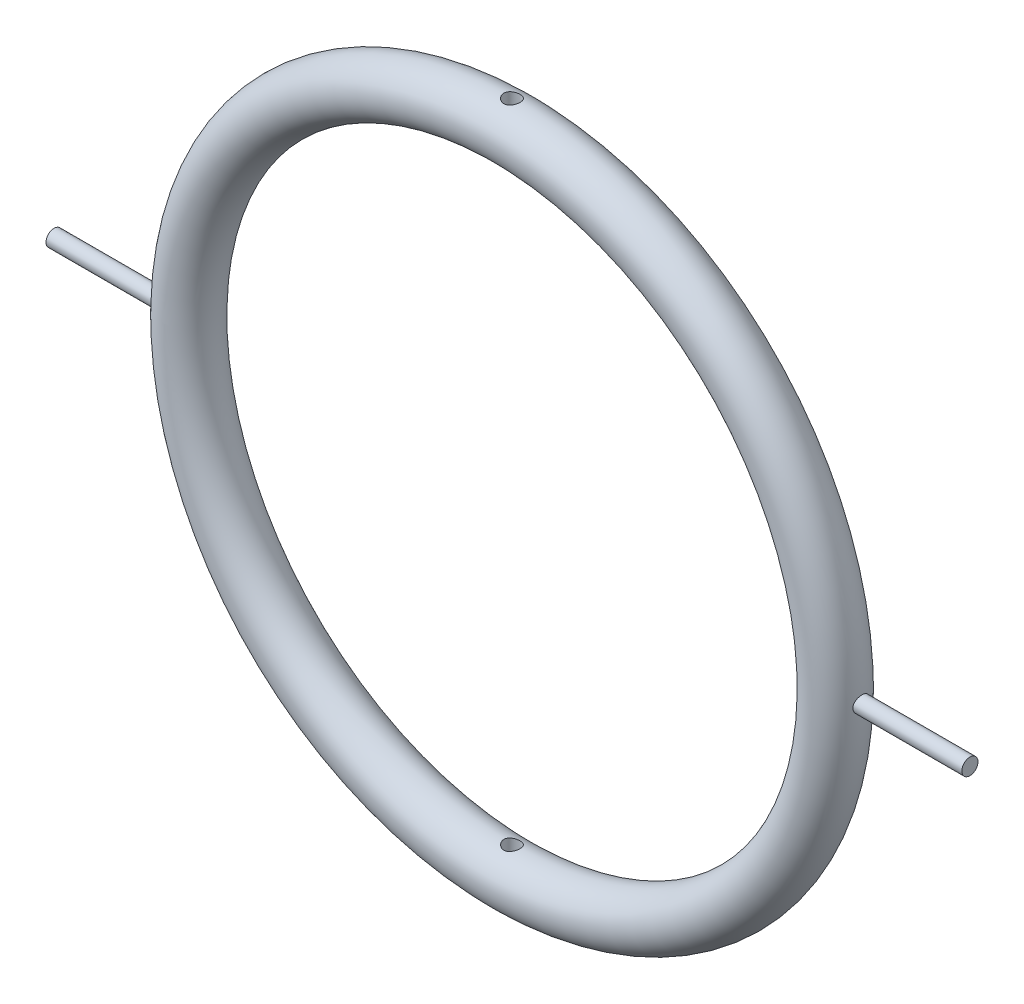
ISO-10303-21;
HEADER;
FILE_DESCRIPTION(('STEP AP214'),'2;1');
FILE_NAME('part.step','',(''),(''),'','','');
FILE_SCHEMA(('AUTOMOTIVE_DESIGN { 1 0 10303 214 1 1 1 1 }'));
ENDSEC;
DATA;
#1=APPLICATION_CONTEXT('core data for automotive mechanical design processes');
#2=APPLICATION_PROTOCOL_DEFINITION('international standard','automotive_design',2000,#1);
#3=PRODUCT_CONTEXT('',#1,'mechanical');
#4=PRODUCT('Part','Part','',(#3));
#5=PRODUCT_RELATED_PRODUCT_CATEGORY('part','',(#4));
#6=PRODUCT_DEFINITION_FORMATION('','',#4);
#7=PRODUCT_DEFINITION_CONTEXT('part definition',#1,'design');
#8=PRODUCT_DEFINITION('design','',#6,#7);
#9=PRODUCT_DEFINITION_SHAPE('','',#8);
#10=(LENGTH_UNIT() NAMED_UNIT(*) SI_UNIT(.MILLI.,.METRE.));
#11=(NAMED_UNIT(*) PLANE_ANGLE_UNIT() SI_UNIT($,.RADIAN.));
#12=(NAMED_UNIT(*) SI_UNIT($,.STERADIAN.) SOLID_ANGLE_UNIT());
#13=UNCERTAINTY_MEASURE_WITH_UNIT(LENGTH_MEASURE(1.E-05),#10,'distance_accuracy_value','');
#14=(GEOMETRIC_REPRESENTATION_CONTEXT(3) GLOBAL_UNCERTAINTY_ASSIGNED_CONTEXT((#13)) GLOBAL_UNIT_ASSIGNED_CONTEXT((#10,
#11,#12)) REPRESENTATION_CONTEXT('',''));
#15=CARTESIAN_POINT('',(0.,0.,0.));
#16=DIRECTION('',(0.,0.,1.));
#17=DIRECTION('',(1.,0.,0.));
#18=AXIS2_PLACEMENT_3D('',#15,#16,#17);
#19=CARTESIAN_POINT('',(0.,0.,0.));
#20=DIRECTION('',(0.,0.,-1.));
#21=DIRECTION('',(-1.,0.,0.));
#22=AXIS2_PLACEMENT_3D('',#19,#20,#21);
#23=TOROIDAL_SURFACE('',#22,30.,2.5);
#24=CARTESIAN_POINT('',(-0.516545828097218,-32.4360347018828,-0.543765029655096));
#25=CARTESIAN_POINT('',(-0.486217906625457,-32.4300971937778,-0.572573962041553));
#26=CARTESIAN_POINT('',(-0.453467232842257,-32.4241835079886,-0.598850478935153));
#27=CARTESIAN_POINT('',(-0.383951718166221,-32.4130599731359,-0.645629131491826));
#28=CARTESIAN_POINT('',(-0.347185736375273,-32.4078503250614,-0.666129620016488));
#29=CARTESIAN_POINT('',(-0.27054978250413,-32.3987375266279,-0.700765705094013));
#30=CARTESIAN_POINT('',(-0.230675803380677,-32.3948360984375,-0.714892920112902));
#31=CARTESIAN_POINT('',(-0.148998095339258,-32.3888347540093,-0.736261010818318));
#32=CARTESIAN_POINT('',(-0.107194967723558,-32.3867342803699,-0.743504017265974));
#33=CARTESIAN_POINT('',(-0.0240265252449548,-32.3846333947645,-0.75074567776761));
#34=CARTESIAN_POINT('',(0.0173212822983761,-32.38457908336,-0.750930264724967));
#35=CARTESIAN_POINT('',(0.0994402894287069,-32.3864406232645,-0.7445184088769));
#36=CARTESIAN_POINT('',(0.140211508645665,-32.3883564073371,-0.73792219749));
#37=CARTESIAN_POINT('',(0.219425901961156,-32.3938805239621,-0.718326843021919));
#38=CARTESIAN_POINT('',(0.257894251768132,-32.3974639251867,-0.705421878685199));
#39=CARTESIAN_POINT('',(0.332137840138536,-32.4059022336169,-0.673658296918244));
#40=CARTESIAN_POINT('',(0.367912636496887,-32.4107573490186,-0.654798704534991));
#41=CARTESIAN_POINT('',(0.436899794695349,-32.4213666470318,-0.611012637938944));
#42=CARTESIAN_POINT('',(0.470005724469682,-32.4271430885445,-0.585923913870165));
#43=CARTESIAN_POINT('',(0.531622526580189,-32.4388555945455,-0.530651585995148));
#44=CARTESIAN_POINT('',(0.560132548602581,-32.4447916883352,-0.500467041493655));
#45=CARTESIAN_POINT('',(0.612539769603563,-32.4563518560151,-0.434862257956074));
#46=CARTESIAN_POINT('',(0.636288584110953,-32.4619628631689,-0.399320881082018));
#47=CARTESIAN_POINT('',(0.677461844550355,-32.4720650083203,-0.324598873678356));
#48=CARTESIAN_POINT('',(0.694886985308361,-32.476556269335,-0.285418643569352));
#49=CARTESIAN_POINT('',(0.722633291818297,-32.4838576941497,-0.205128687654013));
#50=CARTESIAN_POINT('',(0.733057066434288,-32.4866920568006,-0.164056705633205));
#51=CARTESIAN_POINT('',(0.746845826465877,-32.4904648522642,-0.0806623741080339));
#52=CARTESIAN_POINT('',(0.750212400607879,-32.4914037117934,-0.0383403082002727));
#53=CARTESIAN_POINT('',(0.749773855815923,-32.4912824801415,0.0449002503428341));
#54=CARTESIAN_POINT('',(0.746195275322901,-32.4902855310209,0.0858202270787036));
#55=CARTESIAN_POINT('',(0.732439365249372,-32.4865244721577,0.166448676484002));
#56=CARTESIAN_POINT('',(0.722262070239466,-32.4837603716732,0.206157155499313));
#57=CARTESIAN_POINT('',(0.69566014706856,-32.4767593671678,0.283226729349846));
#58=CARTESIAN_POINT('',(0.679242676474088,-32.4725241510142,0.320590456652312));
#59=CARTESIAN_POINT('',(0.640649273707025,-32.4630139230744,0.392070220042934));
#60=CARTESIAN_POINT('',(0.618472303748448,-32.4577387239383,0.426185669318586));
#61=CARTESIAN_POINT('',(0.568179960028189,-32.4465077303052,0.491342528154799));
#62=CARTESIAN_POINT('',(0.53990102339583,-32.440535846154,0.522254963795823));
#63=CARTESIAN_POINT('',(0.478585413374479,-32.4286932869312,0.578964986189826));
#64=CARTESIAN_POINT('',(0.445547975218124,-32.4228226282984,0.604761749185321));
#65=CARTESIAN_POINT('',(0.374882153374492,-32.4117289060378,0.650983054119558));
#66=CARTESIAN_POINT('',(0.337178574159475,-32.4065202383885,0.671296412865985));
#67=CARTESIAN_POINT('',(0.258723111640545,-32.3975163741367,0.705257683878528));
#68=CARTESIAN_POINT('',(0.217971874796428,-32.3937208787918,0.718907005101555));
#69=CARTESIAN_POINT('',(0.135624458278171,-32.3880988040784,0.738820928508976));
#70=CARTESIAN_POINT('',(0.0940729964269705,-32.3862265439335,0.7452572108153));
#71=CARTESIAN_POINT('',(0.0104410920631241,-32.3845300669741,0.751097294515255));
#72=CARTESIAN_POINT('',(-0.0316392392982906,-32.3847054267753,0.750502549706528));
#73=CARTESIAN_POINT('',(-0.113749526931649,-32.3870425980319,0.742435409984904));
#74=CARTESIAN_POINT('',(-0.153802573030075,-32.3891425448996,0.735177195582401));
#75=CARTESIAN_POINT('',(-0.232098585459298,-32.3949896824155,0.714333168628369));
#76=CARTESIAN_POINT('',(-0.270341390077209,-32.3987370199225,0.700746791938834));
#77=CARTESIAN_POINT('',(-0.344477279466111,-32.4075047583643,0.667463081729114));
#78=CARTESIAN_POINT('',(-0.380335698585224,-32.4125402432721,0.6476926769455));
#79=CARTESIAN_POINT('',(-0.448300233325681,-32.4233048772142,0.602652272522084));
#80=CARTESIAN_POINT('',(-0.480405547156237,-32.4290341739399,0.577381101019882));
#81=CARTESIAN_POINT('',(-0.541165285210031,-32.4407914564629,0.520979109987702));
#82=CARTESIAN_POINT('',(-0.569653974079417,-32.4468227719736,0.48967016831069));
#83=CARTESIAN_POINT('',(-0.621011347619349,-32.4583208115676,0.422643424543265));
#84=CARTESIAN_POINT('',(-0.643879782483206,-32.4637875105489,0.386925426586935));
#85=CARTESIAN_POINT('',(-0.683423855269501,-32.4735817613232,0.311834253095213));
#86=CARTESIAN_POINT('',(-0.700068874067696,-32.4779036510873,0.272444166330141));
#87=CARTESIAN_POINT('',(-0.7264522473535,-32.4848855224681,0.191277183880149));
#88=CARTESIAN_POINT('',(-0.736192280882352,-32.4875459080835,0.149500871110271));
#89=CARTESIAN_POINT('',(-0.748226686326749,-32.4908484695045,0.0661425491684288));
#90=CARTESIAN_POINT('',(-0.750743398966734,-32.4915508930124,0.0245949744197694));
#91=CARTESIAN_POINT('',(-0.74887715286079,-32.4910340158918,-0.0583322028822991));
#92=CARTESIAN_POINT('',(-0.744494590943675,-32.4898148257897,-0.0997118149592508));
#93=CARTESIAN_POINT('',(-0.729133195667151,-32.4856282771453,-0.180326949935325));
#94=CARTESIAN_POINT('',(-0.718278669442733,-32.4826938829394,-0.219588046166953));
#95=CARTESIAN_POINT('',(-0.690429788298345,-32.4754080565859,-0.295718155194405));
#96=CARTESIAN_POINT('',(-0.673436419164079,-32.4710568519631,-0.332587550932873));
#97=CARTESIAN_POINT('',(-0.635291401841951,-32.4617405888876,-0.400379304543943));
#98=CARTESIAN_POINT('',(-0.614543993859846,-32.4568454375276,-0.431540091236965));
#99=CARTESIAN_POINT('',(-0.568688383095566,-32.4466388175228,-0.490393280658551));
#100=CARTESIAN_POINT('',(-0.543579621008629,-32.4413272955302,-0.518085237755756));
#101=CARTESIAN_POINT('',(-0.516545828097218,-32.4360347018828,-0.543765029655096));
#102=B_SPLINE_CURVE_WITH_KNOTS('',3,(#24,#25,#26,#27,#28,#29,#30,#31,#32,#33,#34,#35,#36,#37,
#38,#39,#40,#41,#42,#43,#44,#45,#46,#47,#48,#49,#50,#51,#52,#53,#54,#55,#56,#57,#58,#59,#60,#61,
#62,#63,#64,#65,#66,#67,#68,#69,#70,#71,#72,#73,#74,#75,#76,#77,#78,#79,#80,#81,#82,#83,#84,#85,
#86,#87,#88,#89,#90,#91,#92,#93,#94,#95,#96,#97,#98,#99,#100,#101),.UNSPECIFIED.,.T.,.F.,(4,2,2,
2,2,2,2,2,2,2,2,2,2,2,2,2,2,2,2,2,2,2,2,2,2,2,2,2,2,2,2,2,2,2,2,2,2,2,4),(0.,0.126617275788054,
0.253270622309412,0.380090049371611,0.506870211210496,0.630308363473998,0.75374230311752,
0.875387398146819,0.997052420501017,1.1222989351369,1.24756859577898,1.37628258702675,
1.50498243128849,1.63175236658855,1.75849376020514,1.88117047142228,2.00384653994253,
2.12638231990115,2.24894019453207,2.37531844771675,2.50171703462015,2.6305131820491,
2.75928208670066,2.88491632691457,3.01052459033107,3.13223169844206,3.25394965847929,
3.37716394828538,3.50040451292996,3.62807948866921,3.75576013822622,3.88406095723636,
4.0123305674434,4.13660721745538,4.2608767196501,4.38283296520151,4.50476963551326,
4.6176196369716,4.7304841211351),.UNSPECIFIED.);
#103=CARTESIAN_POINT('',(-0.516545828097218,-32.4360347018828,-0.543765029655096));
#104=VERTEX_POINT('',#103);
#105=EDGE_CURVE('E39',#104,#104,#102,.T.);
#106=ORIENTED_EDGE('',*,*,#105,.F.);
#107=EDGE_LOOP('',(#106));
#108=FACE_BOUND('',#107,.T.);
#109=CARTESIAN_POINT('',(-0.52028363604633,-27.5541469516629,-0.540189724136439));
#110=CARTESIAN_POINT('',(-0.550452828966705,-27.5471458998473,-0.51113189947429));
#111=CARTESIAN_POINT('',(-0.578184648737589,-27.5401264292094,-0.479543701895872));
#112=CARTESIAN_POINT('',(-0.62805084800939,-27.5268057872982,-0.412081738742043));
#113=CARTESIAN_POINT('',(-0.650185221473604,-27.5205046167996,-0.376207968544814));
#114=CARTESIAN_POINT('',(-0.688237503633664,-27.509296127534,-0.30101032115929));
#115=CARTESIAN_POINT('',(-0.7041444627968,-27.5043912679647,-0.261680514598021));
#116=CARTESIAN_POINT('',(-0.729130960329237,-27.4965475753118,-0.180723782693328));
#117=CARTESIAN_POINT('',(-0.738212558967513,-27.4936081489821,-0.139097554611894));
#118=CARTESIAN_POINT('',(-0.749020496705216,-27.4900969747937,-0.0561965021688995));
#119=CARTESIAN_POINT('',(-0.750978555301687,-27.4894506530728,-0.0149550185199672));
#120=CARTESIAN_POINT('',(-0.74810915469151,-27.4903895918649,0.067262167446586));
#121=CARTESIAN_POINT('',(-0.74328241988442,-27.4919746141415,0.108237897668964));
#122=CARTESIAN_POINT('',(-0.727223522072438,-27.4971358632536,0.187757343516214));
#123=CARTESIAN_POINT('',(-0.716146053232842,-27.5006639539339,0.226335695074643));
#124=CARTESIAN_POINT('',(-0.688072780659055,-27.5093112415308,0.301082039502716));
#125=CARTESIAN_POINT('',(-0.671076119928392,-27.5144306688337,0.337249682439632));
#126=CARTESIAN_POINT('',(-0.631074558166622,-27.5259194835561,0.407334105241839));
#127=CARTESIAN_POINT('',(-0.60790617345209,-27.5323214849617,0.441152103605817));
#128=CARTESIAN_POINT('',(-0.556437946931815,-27.5456174966981,0.504523723439882));
#129=CARTESIAN_POINT('',(-0.528136603198081,-27.5525116506759,0.534076092209416));
#130=CARTESIAN_POINT('',(-0.465799874379981,-27.5663710316686,0.589353097645991));
#131=CARTESIAN_POINT('',(-0.431574195653203,-27.573327174797,0.614865987889586));
#132=CARTESIAN_POINT('',(-0.359149729262321,-27.5862103480064,0.659793054608706));
#133=CARTESIAN_POINT('',(-0.320951164082455,-27.5921374356658,0.679207572352557));
#134=CARTESIAN_POINT('',(-0.241931888933313,-27.60219771659,0.711174680943112));
#135=CARTESIAN_POINT('',(-0.201135996266268,-27.6063456101624,0.723783734230296));
#136=CARTESIAN_POINT('',(-0.117841256972185,-27.6123830540816,0.741908427598273));
#137=CARTESIAN_POINT('',(-0.0753431077302631,-27.6142735196722,0.74742694251198));
#138=CARTESIAN_POINT('',(0.00791112447668945,-27.6155131489493,0.751058035741394));
#139=CARTESIAN_POINT('',(0.048650527942458,-27.6149823000374,0.749520262619752));
#140=CARTESIAN_POINT('',(0.12925370025654,-27.6117184878576,0.739892402024716));
#141=CARTESIAN_POINT('',(0.169117491009686,-27.6089855797422,0.731802478655881));
#142=CARTESIAN_POINT('',(0.246392798022268,-27.6016906022055,0.70949950453507));
#143=CARTESIAN_POINT('',(0.283827667526889,-27.5971504561494,0.695359695525554));
#144=CARTESIAN_POINT('',(0.355833141369767,-27.586745262863,0.661413701160853));
#145=CARTESIAN_POINT('',(0.390403094325577,-27.5808799154514,0.641606231710153));
#146=CARTESIAN_POINT('',(0.457326933523181,-27.5681603344484,0.595873787717558));
#147=CARTESIAN_POINT('',(0.489517872082789,-27.5612740795564,0.56971923091773));
#148=CARTESIAN_POINT('',(0.549161977519427,-27.5474574551106,0.512474915403481));
#149=CARTESIAN_POINT('',(0.576614006363662,-27.5405270753734,0.481383974665311));
#150=CARTESIAN_POINT('',(0.626898628753332,-27.5271318299496,0.413914373560885));
#151=CARTESIAN_POINT('',(0.64955001113447,-27.5206897119928,0.377395644103002));
#152=CARTESIAN_POINT('',(0.688355448309092,-27.509263378139,0.300843975815273));
#153=CARTESIAN_POINT('',(0.704510838020752,-27.5042788627639,0.26081176106424));
#154=CARTESIAN_POINT('',(0.729426760471519,-27.4964520591906,0.179442952810056));
#155=CARTESIAN_POINT('',(0.738367257115993,-27.4935578394575,0.138166623511789));
#156=CARTESIAN_POINT('',(0.749193796944404,-27.4900407256835,0.0546081443768922));
#157=CARTESIAN_POINT('',(0.751081920245641,-27.4894171619077,0.012326294824779));
#158=CARTESIAN_POINT('',(0.747804909499886,-27.4904888192553,-0.0701309485048816));
#159=CARTESIAN_POINT('',(0.74293495614658,-27.4920870036965,-0.110319746821382));
#160=CARTESIAN_POINT('',(0.72684273190714,-27.4972575186493,-0.189269217799106));
#161=CARTESIAN_POINT('',(0.715620271427426,-27.5008299080818,-0.228029847799196));
#162=CARTESIAN_POINT('',(0.687140866465856,-27.509594096262,-0.303252773614722));
#163=CARTESIAN_POINT('',(0.669858512105932,-27.5147927038832,-0.339704616426302));
#164=CARTESIAN_POINT('',(0.629781293842273,-27.5262776352403,-0.409252241648055));
#165=CARTESIAN_POINT('',(0.606985067511255,-27.5325642276979,-0.442347191727693));
#166=CARTESIAN_POINT('',(0.555341457805837,-27.545895676126,-0.505809012912093));
#167=CARTESIAN_POINT('',(0.526270332839044,-27.5529618063458,-0.535989501474165));
#168=CARTESIAN_POINT('',(0.463478417710881,-27.566848796284,-0.59112957429285));
#169=CARTESIAN_POINT('',(0.429756701581499,-27.5736696068156,-0.616088116322988));
#170=CARTESIAN_POINT('',(0.357711848874161,-27.5864459382397,-0.660584928152607));
#171=CARTESIAN_POINT('',(0.319305222602592,-27.5923796483936,-0.679994821875612));
#172=CARTESIAN_POINT('',(0.239537970026754,-27.602468354048,-0.712016057050647));
#173=CARTESIAN_POINT('',(0.19817834148431,-27.606623947052,-0.724629682633073));
#174=CARTESIAN_POINT('',(0.115306495538421,-27.6124998110045,-0.742247888207031));
#175=CARTESIAN_POINT('',(0.0738565599603491,-27.6143045096001,-0.747516765382709));
#176=CARTESIAN_POINT('',(-0.00937291457546421,-27.6155259660923,-0.751096546956979));
#177=CARTESIAN_POINT('',(-0.0511523705689554,-27.6149433070388,-0.749409150243818));
#178=CARTESIAN_POINT('',(-0.132141259850038,-27.6115362069771,-0.739350727989369));
#179=CARTESIAN_POINT('',(-0.171387472297616,-27.6087997641321,-0.731241984277554));
#180=CARTESIAN_POINT('',(-0.247937502929917,-27.6015149812197,-0.708954726357603));
#181=CARTESIAN_POINT('',(-0.285241037024455,-27.596966376985,-0.694775327179065));
#182=CARTESIAN_POINT('',(-0.357852812008675,-27.5864319837856,-0.660374569963706));
#183=CARTESIAN_POINT('',(-0.393090822664007,-27.5804140475228,-0.6400151629252));
#184=CARTESIAN_POINT('',(-0.459738851775402,-27.5676522434969,-0.593954669302738));
#185=CARTESIAN_POINT('',(-0.491147869768511,-27.5609081868719,-0.568252191373553));
#186=CARTESIAN_POINT('',(-0.52028363604633,-27.5541469516629,-0.540189724136439));
#187=B_SPLINE_CURVE_WITH_KNOTS('',3,(#109,#110,#111,#112,#113,#114,#115,#116,#117,#118,#119,
#120,#121,#122,#123,#124,#125,#126,#127,#128,#129,#130,#131,#132,#133,#134,#135,#136,#137,#138,
#139,#140,#141,#142,#143,#144,#145,#146,#147,#148,#149,#150,#151,#152,#153,#154,#155,#156,#157,
#158,#159,#160,#161,#162,#163,#164,#165,#166,#167,#168,#169,#170,#171,#172,#173,#174,#175,#176,
#177,#178,#179,#180,#181,#182,#183,#184,#185,#186),.UNSPECIFIED.,.T.,.F.,(4,2,2,2,2,2,2,2,2,2,2,
2,2,2,2,2,2,2,2,2,2,2,2,2,2,2,2,2,2,2,2,2,2,2,2,2,2,2,4),(0.,0.127264293851622,
0.254528724953935,0.382015928113222,0.509464633153822,0.632728545640226,0.755979298471405,
0.876305768728094,0.996649667421353,1.12056853904065,1.24452372857561,1.37366245185794,
1.50279394717729,1.63083694130669,1.75882800447232,1.88054736340978,2.00226367386953,
2.12254638449402,2.24285636862142,2.3684259127736,2.49402557019422,2.62374802016365,
2.75344379869495,2.87979480447265,3.00610853972251,3.12707542364726,3.24804591807622,
3.36952984512939,3.49104382046856,3.617953311691,3.74488810813653,3.87455792737685,
4.00418413918286,4.12901358791932,4.25381255212891,4.37376168435412,4.49372830852825,
4.61660120790639,4.73950614377785),.UNSPECIFIED.);
#188=CARTESIAN_POINT('',(-0.52028363604633,-27.5541469516629,-0.540189724136439));
#189=VERTEX_POINT('',#188);
#190=EDGE_CURVE('E103',#189,#189,#187,.T.);
#191=ORIENTED_EDGE('',*,*,#190,.F.);
#192=EDGE_LOOP('',(#191));
#193=FACE_BOUND('',#192,.T.);
#194=CARTESIAN_POINT('',(-0.558420319878622,27.5449864956615,-0.500666323520871));
#195=CARTESIAN_POINT('',(-0.530307797172159,27.551966731114,-0.532021368369193));
#196=CARTESIAN_POINT('',(-0.499565570571633,27.5590984004541,-0.560989464780827));
#197=CARTESIAN_POINT('',(-0.433590446950507,27.5728835191583,-0.613412445557391));
#198=CARTESIAN_POINT('',(-0.398356960303093,27.5795369055523,-0.636866604883239));
#199=CARTESIAN_POINT('',(-0.324215741320754,27.5916138832134,-0.677625195513017));
#200=CARTESIAN_POINT('',(-0.285302117920474,27.5970354537641,-0.694919548042166));
#201=CARTESIAN_POINT('',(-0.204915459052993,27.6059664508156,-0.722714653152334));
#202=CARTESIAN_POINT('',(-0.16344340143719,27.6094766028944,-0.733217983902278));
#203=CARTESIAN_POINT('',(-0.080584692474767,27.6140500214577,-0.746799680841778));
#204=CARTESIAN_POINT('',(-0.0392408299365849,27.6151905825754,-0.750112757011072));
#205=CARTESIAN_POINT('',(0.0434219130509608,27.6151114179349,-0.749881415881924));
#206=CARTESIAN_POINT('',(0.0847407963000193,27.6138920429478,-0.746338017701339));
#207=CARTESIAN_POINT('',(0.164789076929215,27.6093256665189,-0.73276189320492));
#208=CARTESIAN_POINT('',(0.203559010660574,27.6060485593615,-0.722942163845666));
#209=CARTESIAN_POINT('',(0.278890928009097,27.5978097357802,-0.697354304112926));
#210=CARTESIAN_POINT('',(0.315452562114952,27.5928477535068,-0.681585234974475));
#211=CARTESIAN_POINT('',(0.3865032471911,27.5816145450959,-0.644031362621727));
#212=CARTESIAN_POINT('',(0.420901953007416,27.5753096478879,-0.622085983904181));
#213=CARTESIAN_POINT('',(0.485638633827099,27.5621569845017,-0.572980610443332));
#214=CARTESIAN_POINT('',(0.51597545148403,27.5553090644822,-0.545819134830533));
#215=CARTESIAN_POINT('',(0.573161762555898,27.5414616731885,-0.485579679700462));
#216=CARTESIAN_POINT('',(0.599788651133014,27.5344695684388,-0.452288110472763));
#217=CARTESIAN_POINT('',(0.647095269278408,27.5214310837434,-0.381546698736065));
#218=CARTESIAN_POINT('',(0.667775152976198,27.5153846792897,-0.344096964029806));
#219=CARTESIAN_POINT('',(0.702442022374813,27.5049464271477,-0.26623487227065));
#220=CARTESIAN_POINT('',(0.716463820389371,27.5005459995972,-0.225839228011906));
#221=CARTESIAN_POINT('',(0.737458646835066,27.493867740973,-0.143090928438234));
#222=CARTESIAN_POINT('',(0.744434153787814,27.4915891635639,-0.100738966740283));
#223=CARTESIAN_POINT('',(0.750912093943508,27.4894739343662,-0.017342762678147));
#224=CARTESIAN_POINT('',(0.750738581535964,27.4895313919614,0.023673869015224));
#225=CARTESIAN_POINT('',(0.74372640289424,27.4918193181291,0.105067772882223));
#226=CARTESIAN_POINT('',(0.736888263789087,27.494049614844,0.145445095364416));
#227=CARTESIAN_POINT('',(0.716960876585191,27.5003874584593,0.223774446284598));
#228=CARTESIAN_POINT('',(0.703972636338212,27.5044646274332,0.261754809063055));
#229=CARTESIAN_POINT('',(0.672206422304875,27.5140677347397,0.335012481291929));
#230=CARTESIAN_POINT('',(0.653427400077838,27.5195939353973,0.370289299811289));
#231=CARTESIAN_POINT('',(0.609836892296788,27.5317639081928,0.438515596508869));
#232=CARTESIAN_POINT('',(0.584833456540733,27.5384406154071,0.471336485779457));
#233=CARTESIAN_POINT('',(0.529826990466603,27.5520732488087,0.53242249342831));
#234=CARTESIAN_POINT('',(0.499822544700004,27.5590292536219,0.560686317540612));
#235=CARTESIAN_POINT('',(0.43432373709371,27.572745777744,0.612929052403541));
#236=CARTESIAN_POINT('',(0.398666157241907,27.5794892860464,0.636708440740471));
#237=CARTESIAN_POINT('',(0.323653065461211,27.5917027861293,0.677922663702218));
#238=CARTESIAN_POINT('',(0.284298115583086,27.597172971034,0.695358460682432));
#239=CARTESIAN_POINT('',(0.203715055421888,27.6060734189113,0.723036326228912));
#240=CARTESIAN_POINT('',(0.16253383520021,27.6095388641831,0.73340307369783));
#241=CARTESIAN_POINT('',(0.0788907317449483,27.6141312990984,0.747040839317508));
#242=CARTESIAN_POINT('',(0.0364293338651357,27.6152591639536,0.750314513201724));
#243=CARTESIAN_POINT('',(-0.0463683607718711,27.6150340340438,0.749653929259203));
#244=CARTESIAN_POINT('',(-0.0867081650594758,27.6137983260311,0.74606044593565));
#245=CARTESIAN_POINT('',(-0.166168282676385,27.6092279747451,0.732470413466269));
#246=CARTESIAN_POINT('',(-0.205288557589282,27.6058932654211,0.722473662824361));
#247=CARTESIAN_POINT('',(-0.281195123970016,27.5975219962278,0.696446218360961));
#248=CARTESIAN_POINT('',(-0.31798492474067,27.5924880711088,0.680424861744782));
#249=CARTESIAN_POINT('',(-0.388415788589454,27.581268130691,0.642827960910586));
#250=CARTESIAN_POINT('',(-0.422056062143014,27.5750818276696,0.621251029075583));
#251=CARTESIAN_POINT('',(-0.486934529898025,27.5618866026799,0.571954583951465));
#252=CARTESIAN_POINT('',(-0.517983516825044,27.5548525975623,0.543992561238671));
#253=CARTESIAN_POINT('',(-0.575043914243135,27.5409732545093,0.483281031874189));
#254=CARTESIAN_POINT('',(-0.601054337325158,27.5341279537792,0.450530589036399));
#255=CARTESIAN_POINT('',(-0.647920714239045,27.52119590391,0.380169327415228));
#256=CARTESIAN_POINT('',(-0.668632934085118,27.5151321609165,0.342458161501579));
#257=CARTESIAN_POINT('',(-0.703366275015334,27.5046620548537,0.263857079042492));
#258=CARTESIAN_POINT('',(-0.717389201970352,27.5002552445397,0.222968023884401));
#259=CARTESIAN_POINT('',(-0.737882550259502,27.493729088272,0.140606134340115));
#260=CARTESIAN_POINT('',(-0.744587534824074,27.4915388737857,0.0991973911826135));
#261=CARTESIAN_POINT('',(-0.750998736245847,27.4894458523655,0.0157882873157753));
#262=CARTESIAN_POINT('',(-0.750706658400786,27.489542488089,-0.0262119267486933));
#263=CARTESIAN_POINT('',(-0.743285530398208,27.4919624766251,-0.107914136206312));
#264=CARTESIAN_POINT('',(-0.736417228509609,27.4942009047717,-0.147642747394267));
#265=CARTESIAN_POINT('',(-0.716468755382659,27.5005424522208,-0.225348295189761));
#266=CARTESIAN_POINT('',(-0.703388319580785,27.5046456509403,-0.263325157117893));
#267=CARTESIAN_POINT('',(-0.67138400759816,27.5143117874988,-0.336675734445048));
#268=CARTESIAN_POINT('',(-0.652440698158585,27.5198795705426,-0.372040300859445));
#269=CARTESIAN_POINT('',(-0.609257155991229,27.5319150620078,-0.439204745555569));
#270=CARTESIAN_POINT('',(-0.585015483435495,27.538383014876,-0.471003651309582));
#271=CARTESIAN_POINT('',(-0.558420319878622,27.5449864956615,-0.500666323520871));
#272=B_SPLINE_CURVE_WITH_KNOTS('',3,(#194,#195,#196,#197,#198,#199,#200,#201,#202,#203,#204,
#205,#206,#207,#208,#209,#210,#211,#212,#213,#214,#215,#216,#217,#218,#219,#220,#221,#222,#223,
#224,#225,#226,#227,#228,#229,#230,#231,#232,#233,#234,#235,#236,#237,#238,#239,#240,#241,#242,
#243,#244,#245,#246,#247,#248,#249,#250,#251,#252,#253,#254,#255,#256,#257,#258,#259,#260,#261,
#262,#263,#264,#265,#266,#267,#268,#269,#270,#271),.UNSPECIFIED.,.T.,.F.,(4,2,2,2,2,2,2,2,2,2,2,
2,2,2,2,2,2,2,2,2,2,2,2,2,2,2,2,2,2,2,2,2,2,2,2,2,2,2,4),(0.,0.127920775841082,
0.255858362855376,0.384004332025211,0.512101622769221,0.635950303665061,0.759780577621599,
0.879616758087561,0.999471855793917,1.12278821293503,1.24613963194898,1.37512576683621,
1.50410855846704,1.63240931819161,1.76066493259789,1.88311359505932,2.00555257340648,
2.12604692099183,2.24656309730844,2.37139519145121,2.49626267732176,2.62579498337234,
2.75530763050478,2.88247245614519,3.00958966148696,3.13056215282359,3.25153845107303,
3.37232802244934,3.49314779277393,3.61968938604292,3.74625575267862,3.87595911307943,
4.00562743834752,4.13100493701191,4.25635187945472,4.376926106929,4.49750546990162,
4.61848886861391,4.73950518548232),.UNSPECIFIED.);
#273=CARTESIAN_POINT('',(-0.558420319878622,27.5449864956615,-0.500666323520871));
#274=VERTEX_POINT('',#273);
#275=EDGE_CURVE('E107',#274,#274,#272,.T.);
#276=ORIENTED_EDGE('',*,*,#275,.F.);
#277=EDGE_LOOP('',(#276));
#278=FACE_BOUND('',#277,.T.);
#279=CARTESIAN_POINT('',(-0.516545828097218,32.4360347018828,-0.543765029655096));
#280=CARTESIAN_POINT('',(-0.546973397426586,32.4419918410105,-0.514859596521222));
#281=CARTESIAN_POINT('',(-0.574975638209447,32.447975474809,-0.483392051978697));
#282=CARTESIAN_POINT('',(-0.625376038354332,32.4593450983734,-0.416138855220041));
#283=CARTESIAN_POINT('',(-0.647772304877391,32.4647308859379,-0.380351750547506));
#284=CARTESIAN_POINT('',(-0.686321870274226,32.4743244273685,-0.305354259655761));
#285=CARTESIAN_POINT('',(-0.702468185924234,32.4785308620768,-0.26614010390656));
#286=CARTESIAN_POINT('',(-0.72794716800778,32.4852901998792,-0.185425966272182));
#287=CARTESIAN_POINT('',(-0.737281728157163,32.4878435625168,-0.143926623138156));
#288=CARTESIAN_POINT('',(-0.748671880772293,32.4909721091059,-0.0608729834766875));
#289=CARTESIAN_POINT('',(-0.750894948095233,32.4915927977771,-0.0193433602130742));
#290=CARTESIAN_POINT('',(-0.748455119772979,32.4909172111685,0.0634950762353746));
#291=CARTESIAN_POINT('',(-0.743792759529599,32.4896210849376,0.104803906338129));
#292=CARTESIAN_POINT('',(-0.727893314543624,32.4852930526421,0.185266123396979));
#293=CARTESIAN_POINT('',(-0.716774992088192,32.4822925215248,0.224444814796156));
#294=CARTESIAN_POINT('',(-0.688416262957808,32.4748902619507,0.300376618516576));
#295=CARTESIAN_POINT('',(-0.671175183120951,32.4704883794289,0.337129463602891));
#296=CARTESIAN_POINT('',(-0.630646818879306,32.4606248912404,0.408028380985447));
#297=CARTESIAN_POINT('',(-0.607239204321904,32.4551428143429,0.44210275027762));
#298=CARTESIAN_POINT('',(-0.5551971085666,32.443750761224,0.505917196126684));
#299=CARTESIAN_POINT('',(-0.526561499033193,32.4378406927975,0.535656334532749));
#300=CARTESIAN_POINT('',(-0.463837522399485,32.4260346901346,0.590892078034836));
#301=CARTESIAN_POINT('',(-0.429609553968429,32.4201446778093,0.616231734585806));
#302=CARTESIAN_POINT('',(-0.35725784527301,32.4092461292636,0.660811606904007));
#303=CARTESIAN_POINT('',(-0.3191342736679,32.404237554907,0.680052086585882));
#304=CARTESIAN_POINT('',(-0.240273947109734,32.3957365732113,0.711731847927734));
#305=CARTESIAN_POINT('',(-0.199555099357185,32.3922348452217,0.724213067184738));
#306=CARTESIAN_POINT('',(-0.11648165433022,32.3871489705243,0.742115944662844));
#307=CARTESIAN_POINT('',(-0.074127534613914,32.3855642682821,0.747539648113718));
#308=CARTESIAN_POINT('',(0.00936970077001351,32.3845387302118,0.751062618294365));
#309=CARTESIAN_POINT('',(0.050501200222827,32.3850224155709,0.749419742868962));
#310=CARTESIAN_POINT('',(0.131874898520772,32.3879022727719,0.73945196369775));
#311=CARTESIAN_POINT('',(0.172117116416749,32.3902984036031,0.731127203239082));
#312=CARTESIAN_POINT('',(0.250252926761107,32.3966853304788,0.708179453890395));
#313=CARTESIAN_POINT('',(0.288163369708241,32.400662599841,0.693609809542606));
#314=CARTESIAN_POINT('',(0.361035063009447,32.4097601367479,0.658625892995513));
#315=CARTESIAN_POINT('',(0.395995769443705,32.4148806144637,0.638210545907749));
#316=CARTESIAN_POINT('',(0.463209696668337,32.4258929877857,0.591329084412572));
#317=CARTESIAN_POINT('',(0.495336781977386,32.4318046524843,0.564686734499715));
#318=CARTESIAN_POINT('',(0.554743659673256,32.4436169708,0.506448675336069));
#319=CARTESIAN_POINT('',(0.582022668594193,32.4495176224852,0.474852167026271));
#320=CARTESIAN_POINT('',(0.6315784639795,32.460807438714,0.406722092857582));
#321=CARTESIAN_POINT('',(0.653726122805438,32.4661817619042,0.370091886508524));
#322=CARTESIAN_POINT('',(0.691521317191589,32.4756600373376,0.293466193402712));
#323=CARTESIAN_POINT('',(0.707169837873908,32.479764182087,0.253471217774781));
#324=CARTESIAN_POINT('',(0.731196052152508,32.4861715590213,0.172092308462857));
#325=CARTESIAN_POINT('',(0.739713586056023,32.488509336074,0.13075245970761));
#326=CARTESIAN_POINT('',(0.749696911434022,32.4912567703081,0.0471699118293581));
#327=CARTESIAN_POINT('',(0.751164147919526,32.4916668225907,0.00492739949689649));
#328=CARTESIAN_POINT('',(0.747060217410618,32.4905315933591,-0.0779022406553074));
#329=CARTESIAN_POINT('',(0.741700169132463,32.4890449603599,-0.118500847483166));
#330=CARTESIAN_POINT('',(0.724487076215524,32.4843746121803,-0.198192950363444));
#331=CARTESIAN_POINT('',(0.712633871828982,32.4811908552466,-0.237286409360165));
#332=CARTESIAN_POINT('',(0.68274843131903,32.4734396471342,-0.313084614814772));
#333=CARTESIAN_POINT('',(0.664688985208675,32.4688661131625,-0.34977798077233));
#334=CARTESIAN_POINT('',(0.622928868040714,32.4588086480873,-0.419663546757834));
#335=CARTESIAN_POINT('',(0.599227087961771,32.453324538071,-0.452855056629884));
#336=CARTESIAN_POINT('',(0.545946945807826,32.4418165143595,-0.515947386369262));
#337=CARTESIAN_POINT('',(0.516202205078375,32.4357808317197,-0.545705665982729));
#338=CARTESIAN_POINT('',(0.452127542024039,32.4239884656393,-0.599867335157969));
#339=CARTESIAN_POINT('',(0.417797045877375,32.4182318172377,-0.624270053559481));
#340=CARTESIAN_POINT('',(0.34492575070561,32.4075759419009,-0.667339118856431));
#341=CARTESIAN_POINT('',(0.306333458615736,32.4026896215034,-0.685921796433377));
#342=CARTESIAN_POINT('',(0.22640594204923,32.3944757154881,-0.716286722848396));
#343=CARTESIAN_POINT('',(0.185071430530028,32.3911477265144,-0.72807073162594));
#344=CARTESIAN_POINT('',(0.102100809904212,32.3865487566192,-0.744183874244884));
#345=CARTESIAN_POINT('',(0.0605076566782871,32.3852213044051,-0.748717897403649));
#346=CARTESIAN_POINT('',(-0.0228677843468441,32.3846122813099,-0.750809774945554));
#347=CARTESIAN_POINT('',(-0.0646500517125272,32.3853304944285,-0.748368365859063));
#348=CARTESIAN_POINT('',(-0.146028663721174,32.3886733884888,-0.736763173853117));
#349=CARTESIAN_POINT('',(-0.18565356916719,32.3912460757219,-0.727782658958349));
#350=CARTESIAN_POINT('',(-0.262811871911486,32.3979346740169,-0.70360783572092));
#351=CARTESIAN_POINT('',(-0.300345635571594,32.4020503137753,-0.688414619739447));
#352=CARTESIAN_POINT('',(-0.369351209880026,32.4109705493498,-0.653791529150592));
#353=CARTESIAN_POINT('',(-0.401067441171706,32.4156885547831,-0.634823153826508));
#354=CARTESIAN_POINT('',(-0.461326126065483,32.4256091094164,-0.592481753391776));
#355=CARTESIAN_POINT('',(-0.489868161306293,32.4308117223225,-0.569108148760195));
#356=CARTESIAN_POINT('',(-0.516545828097218,32.4360347018828,-0.543765029655096));
#357=B_SPLINE_CURVE_WITH_KNOTS('',3,(#279,#280,#281,#282,#283,#284,#285,#286,#287,#288,#289,
#290,#291,#292,#293,#294,#295,#296,#297,#298,#299,#300,#301,#302,#303,#304,#305,#306,#307,#308,
#309,#310,#311,#312,#313,#314,#315,#316,#317,#318,#319,#320,#321,#322,#323,#324,#325,#326,#327,
#328,#329,#330,#331,#332,#333,#334,#335,#336,#337,#338,#339,#340,#341,#342,#343,#344,#345,#346,
#347,#348,#349,#350,#351,#352,#353,#354,#355,#356),.UNSPECIFIED.,.T.,.F.,(4,2,2,2,2,2,2,2,2,2,2,
2,2,2,2,2,2,2,2,2,2,2,2,2,2,2,2,2,2,2,2,2,2,2,2,2,2,2,4),(0.,0.127038381010951,
0.254119598431997,0.381342399760465,0.508529818768624,0.632699054921439,0.756858636345687,
0.878803480975796,1.00076173689198,1.12530320075337,1.24987157570323,1.37823695036573,
1.50659676983139,1.63415078536283,1.76166782819463,1.88457205290971,2.00747364212232,
2.12934568281596,2.25124014734324,2.37712586974614,2.50303191725448,2.63182667733646,
2.76060190791934,2.88678839104946,3.01294901021562,3.13530144646592,3.25765689302507,
3.38055577414311,3.5034788314588,3.63040893595118,3.75735493828401,3.88605002529154,
4.01471178264097,4.13966878301011,4.26461258975609,4.38618320275599,4.50773244953292,
4.61909992237412,4.73048205617466),.UNSPECIFIED.);
#358=CARTESIAN_POINT('',(-0.516545828097218,32.4360347018828,-0.543765029655096));
#359=VERTEX_POINT('',#358);
#360=EDGE_CURVE('E57',#359,#359,#357,.T.);
#361=ORIENTED_EDGE('',*,*,#360,.F.);
#362=EDGE_LOOP('',(#361));
#363=FACE_BOUND('',#362,.T.);
#364=CARTESIAN_POINT('',(32.4383764464966,-0.52837756717082,-0.53227544233294));
#365=CARTESIAN_POINT('',(32.4324260579625,-0.49863159139959,-0.561802675016835));
#366=CARTESIAN_POINT('',(32.4264562144381,-0.46640206874939,-0.58883741371647));
#367=CARTESIAN_POINT('',(32.4151391465257,-0.397797863058514,-0.637196222956771));
#368=CARTESIAN_POINT('',(32.409792124659,-0.361421839276198,-0.658518438884888));
#369=CARTESIAN_POINT('',(32.4003375404846,-0.285425126555982,-0.694843672195924));
#370=CARTESIAN_POINT('',(32.3962315388191,-0.245800431165645,-0.709838742193254));
#371=CARTESIAN_POINT('',(32.3897773744955,-0.164464310591582,-0.732965070644551));
#372=CARTESIAN_POINT('',(32.3874286483954,-0.122753558848223,-0.741098529269961));
#373=CARTESIAN_POINT('',(32.3848258537416,-0.039591851077722,-0.750090652768153));
#374=CARTESIAN_POINT('',(32.384518827792,0.00183758175097684,-0.751133255980648));
#375=CARTESIAN_POINT('',(32.3858971023528,0.0842681876687084,-0.746393303548024));
#376=CARTESIAN_POINT('',(32.3875822964988,0.125269383503329,-0.740611112277376));
#377=CARTESIAN_POINT('',(32.3926898200473,0.20495708949081,-0.722587766450523));
#378=CARTESIAN_POINT('',(32.3960816401288,0.243671348732803,-0.710459906412118));
#379=CARTESIAN_POINT('',(32.4041941396244,0.318526710763508,-0.680199412796247));
#380=CARTESIAN_POINT('',(32.4089150248648,0.354667413910081,-0.66206584906558));
#381=CARTESIAN_POINT('',(32.4193122026535,0.424439503291826,-0.619727287524478));
#382=CARTESIAN_POINT('',(32.4250112461421,0.457974245166798,-0.595368692961175));
#383=CARTESIAN_POINT('',(32.4366468281956,0.520566221865381,-0.541494779319529));
#384=CARTESIAN_POINT('',(32.4425834124277,0.549622590462752,-0.511978464962752));
#385=CARTESIAN_POINT('',(32.4542354595473,0.603299909159167,-0.447589742424955));
#386=CARTESIAN_POINT('',(32.4599393286238,0.627765757821438,-0.412585622591268));
#387=CARTESIAN_POINT('',(32.4703003760447,0.67046123636463,-0.338817512662016));
#388=CARTESIAN_POINT('',(32.4749576476492,0.688691421967398,-0.300053858011338));
#389=CARTESIAN_POINT('',(32.4826544282053,0.718143548427696,-0.220345658565673));
#390=CARTESIAN_POINT('',(32.4857133281897,0.729449793032798,-0.179434215208408));
#391=CARTESIAN_POINT('',(32.4899561079973,0.74500808379631,-0.0961995452243649));
#392=CARTESIAN_POINT('',(32.4911404228902,0.749261766784784,-0.0538766485088103));
#393=CARTESIAN_POINT('',(32.4914948841289,0.75054077469369,0.0295002034695847));
#394=CARTESIAN_POINT('',(32.490729465057,0.747797335875624,0.0705505230217574));
#395=CARTESIAN_POINT('',(32.4874023148085,0.735664326231046,0.151578937124245));
#396=CARTESIAN_POINT('',(32.4848406190712,0.72627488652572,0.19155705281228));
#397=CARTESIAN_POINT('',(32.478204007844,0.701211193624982,0.269185294426336));
#398=CARTESIAN_POINT('',(32.4741347879916,0.68556057847599,0.306843568317704));
#399=CARTESIAN_POINT('',(32.4648989859342,0.648447046457717,0.379030805646865));
#400=CARTESIAN_POINT('',(32.4597322152076,0.626983130887546,0.413559230027878));
#401=CARTESIAN_POINT('',(32.4486565344498,0.578094821124127,0.479630906554456));
#402=CARTESIAN_POINT('',(32.4427299217874,0.550509971200811,0.511052487768205));
#403=CARTESIAN_POINT('',(32.4308968323018,0.490507017456706,0.56889363565166));
#404=CARTESIAN_POINT('',(32.4249903591738,0.458088070854953,0.595312328286347));
#405=CARTESIAN_POINT('',(32.4137281969331,0.388500359845243,0.64294805791385));
#406=CARTESIAN_POINT('',(32.4083868064735,0.351245606985481,0.664043203233699));
#407=CARTESIAN_POINT('',(32.399045535006,0.273551970180305,0.699638573392976));
#408=CARTESIAN_POINT('',(32.3950453987685,0.233113693843811,0.714140053140098));
#409=CARTESIAN_POINT('',(32.3889634831082,0.151133633095032,0.735809908420971));
#410=CARTESIAN_POINT('',(32.3868413980231,0.109635760679698,0.743132739080366));
#411=CARTESIAN_POINT('',(32.3846394258139,0.0259500273802261,0.750726857552461));
#412=CARTESIAN_POINT('',(32.384559080991,-0.0162376767418142,0.750999725761661));
#413=CARTESIAN_POINT('',(32.3864182401135,-0.0986465301831549,0.744594951069021));
#414=CARTESIAN_POINT('',(32.3882921071121,-0.138887002169741,0.73814317559251));
#415=CARTESIAN_POINT('',(32.3937324229898,-0.217686937209801,0.718858892290348));
#416=CARTESIAN_POINT('',(32.3972989992615,-0.256246273503153,0.706025904213719));
#417=CARTESIAN_POINT('',(32.4057535394716,-0.331020505476701,0.674234173139475));
#418=CARTESIAN_POINT('',(32.410653572115,-0.367210047289839,0.655219156464863));
#419=CARTESIAN_POINT('',(32.4212170069258,-0.435954321259937,0.611637977314));
#420=CARTESIAN_POINT('',(32.4268805705716,-0.468508281861353,0.587070639837455));
#421=CARTESIAN_POINT('',(32.4385826905859,-0.530300259969783,0.532028836686616));
#422=CARTESIAN_POINT('',(32.4446273991239,-0.559375450227341,0.501372632339506));
#423=CARTESIAN_POINT('',(32.4562333929986,-0.612014926167764,0.435560975820162));
#424=CARTESIAN_POINT('',(32.4617946469523,-0.635578854260072,0.400405231930434));
#425=CARTESIAN_POINT('',(32.4718664513816,-0.676676030361339,0.326222055517585));
#426=CARTESIAN_POINT('',(32.4763685652091,-0.694161352167543,0.287166847016556));
#427=CARTESIAN_POINT('',(32.4837587851459,-0.722269270313219,0.206517558429459));
#428=CARTESIAN_POINT('',(32.4866472731902,-0.732893490724439,0.164924081722814));
#429=CARTESIAN_POINT('',(32.4904223246532,-0.746690307112221,0.0817202597263881));
#430=CARTESIAN_POINT('',(32.4913665190719,-0.750077534322518,0.0401480925919229));
#431=CARTESIAN_POINT('',(32.491322742518,-0.749919789653467,-0.0429814884573135));
#432=CARTESIAN_POINT('',(32.4903349075004,-0.746375305551712,-0.0845389032043746));
#433=CARTESIAN_POINT('',(32.4865760702748,-0.732628609907399,-0.165557324211179));
#434=CARTESIAN_POINT('',(32.4838424481553,-0.722565900899879,-0.205043928490145));
#435=CARTESIAN_POINT('',(32.4769119997581,-0.696247834778848,-0.281749234523152));
#436=CARTESIAN_POINT('',(32.4727154426429,-0.679993616778223,-0.318968351988911));
#437=CARTESIAN_POINT('',(32.4636670191866,-0.643321637723187,-0.38732277925161));
#438=CARTESIAN_POINT('',(32.45889513532,-0.623344553327745,-0.418706648783997));
#439=CARTESIAN_POINT('',(32.4488794237829,-0.579017888561121,-0.478134785601467));
#440=CARTESIAN_POINT('',(32.4436355336966,-0.55466772949077,-0.506178610072716));
#441=CARTESIAN_POINT('',(32.4383764464966,-0.52837756717082,-0.53227544233294));
#442=B_SPLINE_CURVE_WITH_KNOTS('',3,(#364,#365,#366,#367,#368,#369,#370,#371,#372,#373,#374,
#375,#376,#377,#378,#379,#380,#381,#382,#383,#384,#385,#386,#387,#388,#389,#390,#391,#392,#393,
#394,#395,#396,#397,#398,#399,#400,#401,#402,#403,#404,#405,#406,#407,#408,#409,#410,#411,#412,
#413,#414,#415,#416,#417,#418,#419,#420,#421,#422,#423,#424,#425,#426,#427,#428,#429,#430,#431,
#432,#433,#434,#435,#436,#437,#438,#439,#440,#441),.UNSPECIFIED.,.T.,.F.,(4,2,2,2,2,2,2,2,2,2,2,
2,2,2,2,2,2,2,2,2,2,2,2,2,2,2,2,2,2,2,2,2,2,2,2,2,2,2,4),(0.,0.126869316402919,
0.253779772086831,0.38084916599062,0.507877799668663,0.631598276599169,0.755312148415892,
0.876889041958993,0.998484773937481,1.12343267789261,1.24840471956101,1.37704249454859,
1.50566880235807,1.63269612978233,1.7596939712864,1.88254962894883,2.00540286281824,
2.12779659643629,2.25021137014192,2.37632373210105,2.50245810637011,2.6312613998955,
2.76004016928203,2.88598300597905,3.01189760971068,3.13371519341896,3.25554194652403,
3.37851025874051,3.50150461832118,3.62895419401718,3.75641203680841,3.8848531561014,
4.01326386130874,4.13781010197586,4.26234757876395,4.38430404037447,4.50623807528236,
4.61835318278076,4.73048313767972),.UNSPECIFIED.);
#443=CARTESIAN_POINT('',(32.4383764464966,-0.52837756717082,-0.53227544233294));
#444=VERTEX_POINT('',#443);
#445=EDGE_CURVE('E10',#444,#444,#442,.T.);
#446=ORIENTED_EDGE('',*,*,#445,.F.);
#447=EDGE_LOOP('',(#446));
#448=FACE_BOUND('',#447,.T.);
#449=CARTESIAN_POINT('',(-32.4360347018833,-0.516545828099687,-0.543765029652751));
#450=CARTESIAN_POINT('',(-32.4419918410112,-0.54697339742951,-0.51485959651818));
#451=CARTESIAN_POINT('',(-32.4479754748097,-0.574975638212727,-0.483392051974863));
#452=CARTESIAN_POINT('',(-32.4593450983743,-0.625376038358079,-0.416138855214493));
#453=CARTESIAN_POINT('',(-32.4647308859389,-0.647772304881246,-0.380351750541035));
#454=CARTESIAN_POINT('',(-32.4743244273695,-0.686321870278022,-0.305354259647344));
#455=CARTESIAN_POINT('',(-32.4785308620777,-0.702468185927858,-0.266140103897121));
#456=CARTESIAN_POINT('',(-32.48529019988,-0.72794716801075,-0.185425966260708));
#457=CARTESIAN_POINT('',(-32.4878435625175,-0.737281728159651,-0.143926623125671));
#458=CARTESIAN_POINT('',(-32.4909721091063,-0.748671880773579,-0.0608729834617895));
#459=CARTESIAN_POINT('',(-32.4915927977772,-0.750894948095723,-0.0193433601967607));
#460=CARTESIAN_POINT('',(-32.490917211168,-0.74845511977144,0.0634950762543318));
#461=CARTESIAN_POINT('',(-32.4896210849369,-0.743792759526828,0.104803906358315));
#462=CARTESIAN_POINT('',(-32.4852930526406,-0.727893314537954,0.185266123419614));
#463=CARTESIAN_POINT('',(-32.4822925215228,-0.716774992080812,0.224444814820009));
#464=CARTESIAN_POINT('',(-32.4748902619478,-0.68841626294661,0.30037661854245));
#465=CARTESIAN_POINT('',(-32.4704883794255,-0.671175183107646,0.337129463629572));
#466=CARTESIAN_POINT('',(-32.4606248912362,-0.630646818861529,0.40802838101307));
#467=CARTESIAN_POINT('',(-32.4551428143383,-0.607239204301784,0.442102750305388));
#468=CARTESIAN_POINT('',(-32.4437507612188,-0.555197108541624,0.505917196154208));
#469=CARTESIAN_POINT('',(-32.437840692792,-0.526561499005702,0.535656334559884));
#470=CARTESIAN_POINT('',(-32.4260346901289,-0.463837522367523,0.590892078059968));
#471=CARTESIAN_POINT('',(-32.4201446778038,-0.429609553934613,0.616231734609425));
#472=CARTESIAN_POINT('',(-32.4092461292584,-0.357257845235701,0.660811606924215));
#473=CARTESIAN_POINT('',(-32.4042375549022,-0.319134273628952,0.680052086604195));
#474=CARTESIAN_POINT('',(-32.3957365732075,-0.240273947069251,0.711731847941348));
#475=CARTESIAN_POINT('',(-32.3922348452186,-0.199555099316905,0.724213067195789));
#476=CARTESIAN_POINT('',(-32.3871489705225,-0.116481654290823,0.742115944668979));
#477=CARTESIAN_POINT('',(-32.385564268281,-0.0741275345751972,0.747539648117501));
#478=CARTESIAN_POINT('',(-32.384538730212,0.00936970080602592,0.751062618293812));
#479=CARTESIAN_POINT('',(-32.3850224155716,0.0505012002568235,0.749419742866571));
#480=CARTESIAN_POINT('',(-32.3879022727735,0.131874898550511,0.739451963692345));
#481=CARTESIAN_POINT('',(-32.390298403605,0.172117116444247,0.731127203232502));
#482=CARTESIAN_POINT('',(-32.3966853304811,0.250252926784275,0.708179453882108));
#483=CARTESIAN_POINT('',(-32.4006625998434,0.288163369729312,0.693609809533752));
#484=CARTESIAN_POINT('',(-32.4097601367503,0.361035063026415,0.658625892986107));
#485=CARTESIAN_POINT('',(-32.414880614466,0.395995769458668,0.638210545898358));
#486=CARTESIAN_POINT('',(-32.4258929877878,0.463209696680085,0.591329084403298));
#487=CARTESIAN_POINT('',(-32.4318046524863,0.495336781987857,0.564686734490456));
#488=CARTESIAN_POINT('',(-32.4436169708017,0.554743659681324,0.506448675327152));
#489=CARTESIAN_POINT('',(-32.4495176224868,0.582022668601136,0.474852167017679));
#490=CARTESIAN_POINT('',(-32.4608074387153,0.63157846398499,0.406722092849061));
#491=CARTESIAN_POINT('',(-32.4661817619054,0.653726122810463,0.370091886499649));
#492=CARTESIAN_POINT('',(-32.4756600373386,0.691521317195624,0.293466193393207));
#493=CARTESIAN_POINT('',(-32.4797641820879,0.707169837877419,0.253471217765));
#494=CARTESIAN_POINT('',(-32.486171559022,0.731196052155202,0.172092308451664));
#495=CARTESIAN_POINT('',(-32.4885093360746,0.739713586058266,0.13075245969523));
#496=CARTESIAN_POINT('',(-32.4912567703084,0.749696911435,0.0471699118146936));
#497=CARTESIAN_POINT('',(-32.4916668225907,0.751164147919688,0.00492739948113546));
#498=CARTESIAN_POINT('',(-32.4905315933586,0.747060217408797,-0.0779022406735924));
#499=CARTESIAN_POINT('',(-32.489044960359,0.741700169129395,-0.118500847502879));
#500=CARTESIAN_POINT('',(-32.4843746121787,0.724487076209518,-0.198192950385706));
#501=CARTESIAN_POINT('',(-32.4811908552446,0.712633871821284,-0.237286409383545));
#502=CARTESIAN_POINT('',(-32.4734396471313,0.682748431307549,-0.313084614840015));
#503=CARTESIAN_POINT('',(-32.4688661131591,0.664688985195098,-0.349777980798311));
#504=CARTESIAN_POINT('',(-32.4588086480831,0.622928868022646,-0.419663546784803));
#505=CARTESIAN_POINT('',(-32.4533245380664,0.59922708794131,-0.4528550566571));
#506=CARTESIAN_POINT('',(-32.4418165143543,0.545946945782674,-0.515947386395963));
#507=CARTESIAN_POINT('',(-32.4357808317143,0.516202205050995,-0.545705666008712));
#508=CARTESIAN_POINT('',(-32.4239884656338,0.452127541992223,-0.599867335182022));
#509=CARTESIAN_POINT('',(-32.4182318172322,0.417797045843355,-0.624270053582322));
#510=CARTESIAN_POINT('',(-32.4075759418959,0.344925750668441,-0.667339118875629));
#511=CARTESIAN_POINT('',(-32.4026896214989,0.306333458577746,-0.685921796450334));
#512=CARTESIAN_POINT('',(-32.3944757154846,0.226405942010006,-0.716286722860783));
#513=CARTESIAN_POINT('',(-32.3911477265115,0.185071430490392,-0.728070731635999));
#514=CARTESIAN_POINT('',(-32.3865487566176,0.102100809865539,-0.744183874250101));
#515=CARTESIAN_POINT('',(-32.3852213044043,0.0605076566410227,-0.748717897406575));
#516=CARTESIAN_POINT('',(-32.3846122813102,-0.0228677843809151,-0.750809774944431));
#517=CARTESIAN_POINT('',(-32.3853304944293,-0.0646500517448137,-0.748368365856182));
#518=CARTESIAN_POINT('',(-32.3886733884904,-0.146028663749435,-0.736763173847409));
#519=CARTESIAN_POINT('',(-32.3912460757238,-0.185653569193224,-0.727782658951605));
#520=CARTESIAN_POINT('',(-32.3979346740191,-0.262811871933046,-0.703607835712759));
#521=CARTESIAN_POINT('',(-32.4020503137776,-0.30034563559091,-0.688414619730909));
#522=CARTESIAN_POINT('',(-32.4109705493519,-0.369351209894381,-0.653791529142332));
#523=CARTESIAN_POINT('',(-32.4156885547849,-0.401067441183395,-0.634823153818971));
#524=CARTESIAN_POINT('',(-32.4256091094176,-0.461326126072235,-0.592481753386356));
#525=CARTESIAN_POINT('',(-32.4308117223233,-0.489868161310773,-0.569108148756171));
#526=CARTESIAN_POINT('',(-32.4360347018833,-0.516545828099687,-0.543765029652751));
#527=B_SPLINE_CURVE_WITH_KNOTS('',3,(#449,#450,#451,#452,#453,#454,#455,#456,#457,#458,#459,
#460,#461,#462,#463,#464,#465,#466,#467,#468,#469,#470,#471,#472,#473,#474,#475,#476,#477,#478,
#479,#480,#481,#482,#483,#484,#485,#486,#487,#488,#489,#490,#491,#492,#493,#494,#495,#496,#497,
#498,#499,#500,#501,#502,#503,#504,#505,#506,#507,#508,#509,#510,#511,#512,#513,#514,#515,#516,
#517,#518,#519,#520,#521,#522,#523,#524,#525,#526),.UNSPECIFIED.,.T.,.F.,(4,2,2,2,2,2,2,2,2,2,2,
2,2,2,2,2,2,2,2,2,2,2,2,2,2,2,2,2,2,2,2,2,2,2,2,2,2,2,4),(0.,0.127038381013411,
0.254119598436946,0.381342399767998,0.508529818778731,0.632699054935587,0.756858636363884,
0.878803480998921,1.00076173692004,1.12530320078583,1.24987157574009,1.37823695040427,
1.50659676987159,1.63415078540008,1.76166782822893,1.8845720529383,2.00747364214519,
2.12934568283369,2.25124014735583,2.37712586975578,2.50303191726117,2.63182667734331,
2.76060190792634,2.8867883910596,3.01294901022892,3.13530144648392,3.25765689304778,
3.38055577417065,3.50347883149117,3.63040893598675,3.75735493832277,3.88605002532946,
4.01471178267803,4.13966878304223,4.26461258978328,4.3861832027775,4.50773244954873,
4.61909992238202,4.73048205617464),.UNSPECIFIED.);
#528=CARTESIAN_POINT('',(-32.4360347018833,-0.516545828099687,-0.543765029652751));
#529=VERTEX_POINT('',#528);
#530=EDGE_CURVE('E79',#529,#529,#527,.T.);
#531=ORIENTED_EDGE('',*,*,#530,.F.);
#532=EDGE_LOOP('',(#531));
#533=FACE_BOUND('',#532,.T.);
#534=ADVANCED_FACE('F35',(#108,#193,#278,#363,#448,#533),#23,.T.);
#535=CARTESIAN_POINT('',(42.5,0.,0.));
#536=DIRECTION('',(1.,0.,0.));
#537=DIRECTION('',(0.,0.,-1.));
#538=AXIS2_PLACEMENT_3D('',#535,#536,#537);
#539=PLANE('',#538);
#540=CARTESIAN_POINT('',(42.5,0.,0.));
#541=DIRECTION('',(1.,0.,0.));
#542=DIRECTION('',(0.,0.,-1.));
#543=AXIS2_PLACEMENT_3D('',#540,#541,#542);
#544=CIRCLE('',#543,0.75);
#545=CARTESIAN_POINT('',(42.5,0.,-0.75));
#546=VERTEX_POINT('',#545);
#547=EDGE_CURVE('E46',#546,#546,#544,.T.);
#548=ORIENTED_EDGE('',*,*,#547,.T.);
#549=EDGE_LOOP('',(#548));
#550=FACE_BOUND('',#549,.T.);
#551=ADVANCED_FACE('F66',(#550),#539,.T.);
#552=CARTESIAN_POINT('',(-500000.,0.,0.));
#553=DIRECTION('',(1.,0.,0.));
#554=DIRECTION('',(0.,0.,-1.));
#555=AXIS2_PLACEMENT_3D('',#552,#553,#554);
#556=CYLINDRICAL_SURFACE('',#555,0.75);
#557=ORIENTED_EDGE('',*,*,#445,.T.);
#558=EDGE_LOOP('',(#557));
#559=FACE_BOUND('',#558,.T.);
#560=ORIENTED_EDGE('',*,*,#547,.F.);
#561=EDGE_LOOP('',(#560));
#562=FACE_BOUND('',#561,.T.);
#563=ADVANCED_FACE('F61',(#559,#562),#556,.T.);
#564=CARTESIAN_POINT('',(500000.,0.,0.));
#565=DIRECTION('',(-1.,0.,0.));
#566=DIRECTION('',(0.,0.,1.));
#567=AXIS2_PLACEMENT_3D('',#564,#565,#566);
#568=CYLINDRICAL_SURFACE('',#567,0.75);
#569=ORIENTED_EDGE('',*,*,#530,.T.);
#570=EDGE_LOOP('',(#569));
#571=FACE_BOUND('',#570,.T.);
#572=CARTESIAN_POINT('',(-42.5,0.,0.));
#573=DIRECTION('',(1.,0.,0.));
#574=DIRECTION('',(0.,0.,-1.));
#575=AXIS2_PLACEMENT_3D('',#572,#573,#574);
#576=CIRCLE('',#575,0.75);
#577=CARTESIAN_POINT('',(-42.5,0.,-0.75));
#578=VERTEX_POINT('',#577);
#579=EDGE_CURVE('E51',#578,#578,#576,.T.);
#580=ORIENTED_EDGE('',*,*,#579,.T.);
#581=EDGE_LOOP('',(#580));
#582=FACE_BOUND('',#581,.T.);
#583=ADVANCED_FACE('F65',(#571,#582),#568,.T.);
#584=CARTESIAN_POINT('',(-42.5,0.,0.));
#585=DIRECTION('',(-1.,0.,0.));
#586=DIRECTION('',(0.,0.,-1.));
#587=AXIS2_PLACEMENT_3D('',#584,#585,#586);
#588=PLANE('',#587);
#589=ORIENTED_EDGE('',*,*,#579,.F.);
#590=EDGE_LOOP('',(#589));
#591=FACE_BOUND('',#590,.T.);
#592=ADVANCED_FACE('F67',(#591),#588,.T.);
#593=CARTESIAN_POINT('',(0.,-32.5,0.));
#594=DIRECTION('',(0.,1.,0.));
#595=DIRECTION('',(0.,0.,1.));
#596=AXIS2_PLACEMENT_3D('',#593,#594,#595);
#597=CYLINDRICAL_SURFACE('',#596,0.75);
#598=ORIENTED_EDGE('',*,*,#275,.T.);
#599=EDGE_LOOP('',(#598));
#600=FACE_BOUND('',#599,.T.);
#601=ORIENTED_EDGE('',*,*,#360,.T.);
#602=EDGE_LOOP('',(#601));
#603=FACE_BOUND('',#602,.T.);
#604=ADVANCED_FACE('F75',(#600,#603),#597,.F.);
#605=ORIENTED_EDGE('',*,*,#105,.T.);
#606=EDGE_LOOP('',(#605));
#607=FACE_BOUND('',#606,.T.);
#608=ORIENTED_EDGE('',*,*,#190,.T.);
#609=EDGE_LOOP('',(#608));
#610=FACE_BOUND('',#609,.T.);
#611=ADVANCED_FACE('F91',(#607,#610),#597,.F.);
#612=CLOSED_SHELL('',(#534,#551,#563,#583,#592,#604,#611));
#613=MANIFOLD_SOLID_BREP('B2',#612);
#614=ADVANCED_BREP_SHAPE_REPRESENTATION('',(#18,#613),#14);
#615=SHAPE_DEFINITION_REPRESENTATION(#9,#614);
ENDSEC;
END-ISO-10303-21;
